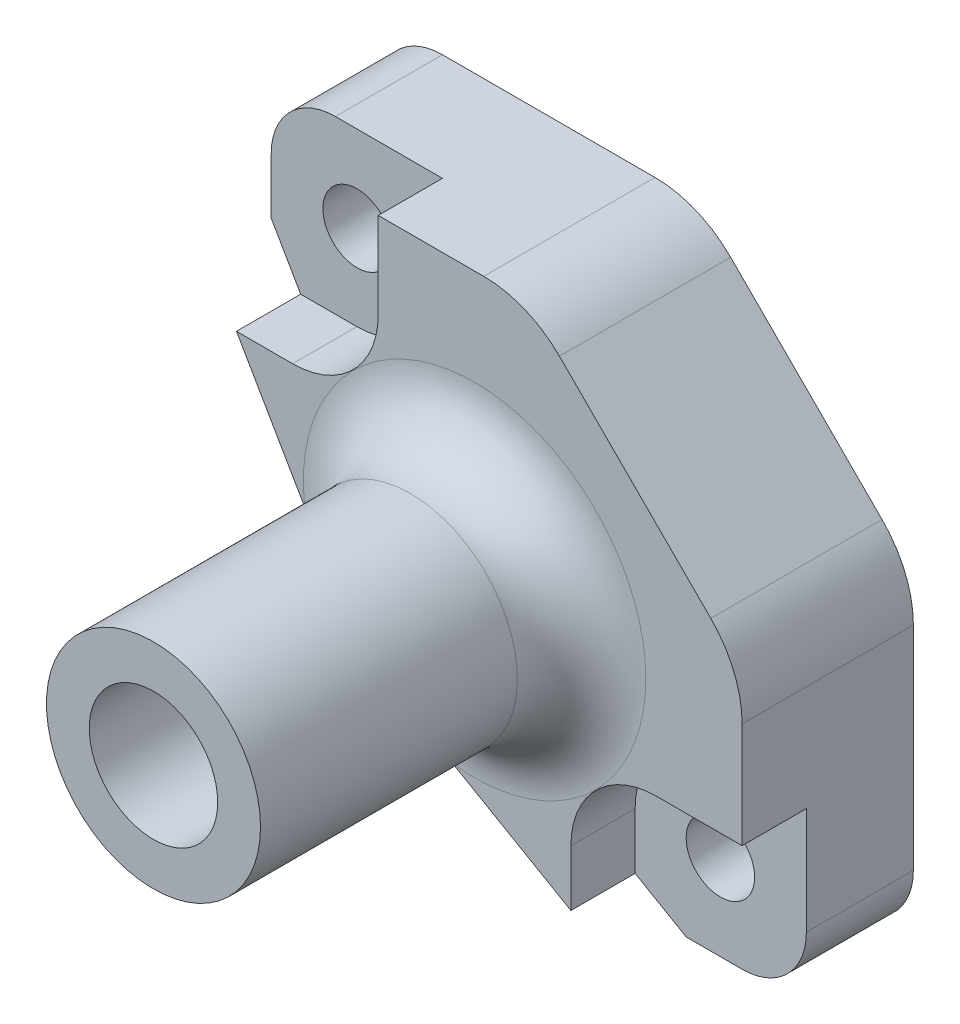
ISO-10303-21;
HEADER;
FILE_DESCRIPTION(('STEP AP214'),'2;1');
FILE_NAME('part.step','',(''),(''),'','','');
FILE_SCHEMA(('AUTOMOTIVE_DESIGN { 1 0 10303 214 1 1 1 1 }'));
ENDSEC;
DATA;
#1=APPLICATION_CONTEXT('core data for automotive mechanical design processes');
#2=APPLICATION_PROTOCOL_DEFINITION('international standard','automotive_design',2000,#1);
#3=PRODUCT_CONTEXT('',#1,'mechanical');
#4=PRODUCT('Part','Part','',(#3));
#5=PRODUCT_RELATED_PRODUCT_CATEGORY('part','',(#4));
#6=PRODUCT_DEFINITION_FORMATION('','',#4);
#7=PRODUCT_DEFINITION_CONTEXT('part definition',#1,'design');
#8=PRODUCT_DEFINITION('design','',#6,#7);
#9=PRODUCT_DEFINITION_SHAPE('','',#8);
#10=(LENGTH_UNIT() NAMED_UNIT(*) SI_UNIT(.MILLI.,.METRE.));
#11=(NAMED_UNIT(*) PLANE_ANGLE_UNIT() SI_UNIT($,.RADIAN.));
#12=(NAMED_UNIT(*) SI_UNIT($,.STERADIAN.) SOLID_ANGLE_UNIT());
#13=UNCERTAINTY_MEASURE_WITH_UNIT(LENGTH_MEASURE(1.E-05),#10,'distance_accuracy_value','');
#14=(GEOMETRIC_REPRESENTATION_CONTEXT(3) GLOBAL_UNCERTAINTY_ASSIGNED_CONTEXT((#13)) GLOBAL_UNIT_ASSIGNED_CONTEXT((#10,
#11,#12)) REPRESENTATION_CONTEXT('',''));
#15=CARTESIAN_POINT('',(0.,0.,0.));
#16=DIRECTION('',(0.,0.,1.));
#17=DIRECTION('',(1.,0.,0.));
#18=AXIS2_PLACEMENT_3D('',#15,#16,#17);
#19=CARTESIAN_POINT('',(0.,0.,11.));
#20=DIRECTION('',(0.,0.,1.));
#21=DIRECTION('',(1.,0.,0.));
#22=AXIS2_PLACEMENT_3D('',#19,#20,#21);
#23=TOROIDAL_SURFACE('',#22,8.,3.);
#24=CARTESIAN_POINT('',(0.,0.,11.));
#25=DIRECTION('',(0.,0.,1.));
#26=DIRECTION('',(1.,0.,0.));
#27=AXIS2_PLACEMENT_3D('',#24,#25,#26);
#28=CIRCLE('',#27,5.);
#29=CARTESIAN_POINT('',(5.,0.,11.));
#30=VERTEX_POINT('',#29);
#31=EDGE_CURVE('E264',#30,#30,#28,.T.);
#32=ORIENTED_EDGE('',*,*,#31,.F.);
#33=EDGE_LOOP('',(#32));
#34=FACE_BOUND('',#33,.T.);
#35=CARTESIAN_POINT('',(-7.93448688415343,-1.02241930220543,8.00000000131894));
#36=CARTESIAN_POINT('',(-7.8088171665432,-1.24009801160835,8.00000243111121));
#37=CARTESIAN_POINT('',(-7.67884244742595,-1.4551843651709,8.00468015560461));
#38=CARTESIAN_POINT('',(-7.4105698135832,-1.87976914803965,8.02025542132506));
#39=CARTESIAN_POINT('',(-7.27227517058231,-2.08926972772333,8.0311505317469));
#40=CARTESIAN_POINT('',(-6.98733676125992,-2.50276113810623,8.05605340391338));
#41=CARTESIAN_POINT('',(-6.84068074754209,-2.70674320581937,8.07006582365957));
#42=CARTESIAN_POINT('',(-6.53933645503834,-3.10871378450686,8.09815838258321));
#43=CARTESIAN_POINT('',(-6.38464744067679,-3.30670174396834,8.11223852785474));
#44=CARTESIAN_POINT('',(-6.0708692126933,-3.6921936004414,8.13742627965764));
#45=CARTESIAN_POINT('',(-5.91195027708333,-3.87983209640176,8.14859217344099));
#46=CARTESIAN_POINT('',(-5.58679354219154,-4.24887794482015,8.16629557736535));
#47=CARTESIAN_POINT('',(-5.42055619637551,-4.43028568211408,8.17283337384654));
#48=CARTESIAN_POINT('',(-5.08123038973987,-4.78634397434978,8.18007152981985));
#49=CARTESIAN_POINT('',(-4.90814920852779,-4.96100133807051,8.18077793265622));
#50=CARTESIAN_POINT('',(-4.55534116188415,-5.30338344577545,8.17623394480544));
#51=CARTESIAN_POINT('',(-4.37561443919472,-5.47110833850116,8.17098368199196));
#52=CARTESIAN_POINT('',(-4.07196346978309,-5.74359486272771,8.15813849286534));
#53=CARTESIAN_POINT('',(-3.94980579510217,-5.85040345626428,8.15194438425557));
#54=CARTESIAN_POINT('',(-3.70283234289101,-6.06079316929327,8.13790663407577));
#55=CARTESIAN_POINT('',(-3.57801650184856,-6.16437421152306,8.13006295305229));
#56=CARTESIAN_POINT('',(-3.1996333732305,-6.47024148093036,8.10497736563694));
#57=CARTESIAN_POINT('',(-2.94217635731903,-6.66761068985613,8.08618330198338));
#58=CARTESIAN_POINT('',(-2.41337987911285,-7.05177412584003,8.05027603628582));
#59=CARTESIAN_POINT('',(-2.14188973425362,-7.23836431587453,8.03319241244911));
#60=CARTESIAN_POINT('',(-1.58925236384683,-7.59725396396319,8.00806159787877));
#61=CARTESIAN_POINT('',(-1.30810503282311,-7.76955326586146,8.00001450587488));
#62=CARTESIAN_POINT('',(-1.02241930220544,-7.93448688415343,8.00000000131894));
#63=B_SPLINE_CURVE_WITH_KNOTS('',3,(#35,#36,#37,#38,#39,#40,#41,#42,#43,#44,#45,#46,#47,#48,#49,
#50,#51,#52,#53,#54,#55,#56,#57,#58,#59,#60,#61,#62),.UNSPECIFIED.,.F.,.F.,(4,2,2,2,2,2,2,2,2,2,
2,2,2,4),(0.,0.753828618587675,1.50736271527105,2.2620304254513,3.0167673622417,
3.75499425669759,4.49317547309418,5.23059158182436,5.9679918605027,6.45508744147399,
6.94219467382236,7.9165939358373,8.90566846173468,9.89475379378134),.UNSPECIFIED.);
#64=CARTESIAN_POINT('',(-7.93437141573023,-1.02261930220543,8.));
#65=VERTEX_POINT('',#64);
#66=CARTESIAN_POINT('',(-1.02261930220543,-7.93437141573022,8.));
#67=VERTEX_POINT('',#66);
#68=EDGE_CURVE('E358',#65,#67,#63,.T.);
#69=ORIENTED_EDGE('',*,*,#68,.T.);
#70=CARTESIAN_POINT('',(0.,0.,8.));
#71=DIRECTION('',(0.,0.,1.));
#72=DIRECTION('',(1.,0.,0.));
#73=AXIS2_PLACEMENT_3D('',#70,#71,#72);
#74=CIRCLE('',#73,8.);
#75=EDGE_CURVE('E274',#65,#67,#74,.F.);
#76=ORIENTED_EDGE('',*,*,#75,.F.);
#77=EDGE_LOOP('',(#69,#76));
#78=FACE_BOUND('',#77,.T.);
#79=ADVANCED_FACE('F32',(#34,#78),#23,.F.);
#80=CARTESIAN_POINT('',(0.,0.,8.));
#81=DIRECTION('',(0.,0.,1.));
#82=DIRECTION('',(1.,0.,0.));
#83=AXIS2_PLACEMENT_3D('',#80,#81,#82);
#84=PLANE('',#83);
#85=DIRECTION('',(-0.500000000000001,0.866025403784438,0.));
#86=VECTOR('',#85,1.);
#87=CARTESIAN_POINT('',(-7.93437141573023,-1.02261930220543,8.));
#88=LINE('',#87,#86);
#89=CARTESIAN_POINT('',(-11.1228571564904,4.5,8.));
#90=VERTEX_POINT('',#89);
#91=EDGE_CURVE('E47',#65,#90,#88,.T.);
#92=ORIENTED_EDGE('',*,*,#91,.F.);
#93=ORIENTED_EDGE('',*,*,#75,.T.);
#94=DIRECTION('',(-0.866025403784438,0.500000000000001,0.));
#95=VECTOR('',#94,1.);
#96=CARTESIAN_POINT('',(-1.02261930220543,-7.93437141573023,8.));
#97=LINE('',#96,#95);
#98=CARTESIAN_POINT('',(4.5,-11.1228571564904,8.));
#99=VERTEX_POINT('',#98);
#100=EDGE_CURVE('E347',#99,#67,#97,.T.);
#101=ORIENTED_EDGE('',*,*,#100,.F.);
#102=DIRECTION('',(0.,1.,0.));
#103=VECTOR('',#102,1.);
#104=CARTESIAN_POINT('',(4.5,0.,8.));
#105=LINE('',#104,#103);
#106=CARTESIAN_POINT('',(4.5,-8.5,8.));
#107=VERTEX_POINT('',#106);
#108=EDGE_CURVE('E277',#99,#107,#105,.T.);
#109=ORIENTED_EDGE('',*,*,#108,.T.);
#110=CARTESIAN_POINT('',(8.5,-8.5,8.));
#111=DIRECTION('',(0.,0.,1.));
#112=DIRECTION('',(1.,0.,0.));
#113=AXIS2_PLACEMENT_3D('',#110,#111,#112);
#114=CIRCLE('',#113,4.);
#115=CARTESIAN_POINT('',(8.5,-4.5,8.));
#116=VERTEX_POINT('',#115);
#117=EDGE_CURVE('E285',#107,#116,#114,.F.);
#118=ORIENTED_EDGE('',*,*,#117,.T.);
#119=DIRECTION('',(1.,0.,0.));
#120=VECTOR('',#119,1.);
#121=CARTESIAN_POINT('',(0.,-4.5,8.));
#122=LINE('',#121,#120);
#123=CARTESIAN_POINT('',(12.5,-4.5,8.));
#124=VERTEX_POINT('',#123);
#125=EDGE_CURVE('E288',#116,#124,#122,.T.);
#126=ORIENTED_EDGE('',*,*,#125,.T.);
#127=DIRECTION('',(0.,1.,0.));
#128=VECTOR('',#127,1.);
#129=CARTESIAN_POINT('',(12.5,12.5,8.));
#130=LINE('',#129,#128);
#131=CARTESIAN_POINT('',(12.5,0.428932188134527,8.));
#132=VERTEX_POINT('',#131);
#133=EDGE_CURVE('E258',#124,#132,#130,.T.);
#134=ORIENTED_EDGE('',*,*,#133,.T.);
#135=CARTESIAN_POINT('',(7.5,0.428932188134527,8.));
#136=DIRECTION('',(0.,0.,1.));
#137=DIRECTION('',(1.,0.,0.));
#138=AXIS2_PLACEMENT_3D('',#135,#136,#137);
#139=CIRCLE('',#138,5.);
#140=CARTESIAN_POINT('',(11.0355339059327,3.96446609406726,8.));
#141=VERTEX_POINT('',#140);
#142=EDGE_CURVE('E301',#132,#141,#139,.T.);
#143=ORIENTED_EDGE('',*,*,#142,.T.);
#144=DIRECTION('',(0.707106781186548,-0.707106781186547,0.));
#145=VECTOR('',#144,1.);
#146=CARTESIAN_POINT('',(2.5,12.5,8.));
#147=LINE('',#146,#145);
#148=CARTESIAN_POINT('',(3.96446609406726,11.0355339059327,8.));
#149=VERTEX_POINT('',#148);
#150=EDGE_CURVE('E372',#149,#141,#147,.T.);
#151=ORIENTED_EDGE('',*,*,#150,.F.);
#152=CARTESIAN_POINT('',(0.428932188134525,7.5,8.));
#153=DIRECTION('',(0.,0.,1.));
#154=DIRECTION('',(1.,0.,0.));
#155=AXIS2_PLACEMENT_3D('',#152,#153,#154);
#156=CIRCLE('',#155,5.);
#157=CARTESIAN_POINT('',(0.428932188134525,12.5,8.));
#158=VERTEX_POINT('',#157);
#159=EDGE_CURVE('E299',#149,#158,#156,.T.);
#160=ORIENTED_EDGE('',*,*,#159,.T.);
#161=DIRECTION('',(-1.,0.,0.));
#162=VECTOR('',#161,1.);
#163=CARTESIAN_POINT('',(-12.5,12.5,8.));
#164=LINE('',#163,#162);
#165=CARTESIAN_POINT('',(-4.5,12.5,8.));
#166=VERTEX_POINT('',#165);
#167=EDGE_CURVE('E261',#158,#166,#164,.T.);
#168=ORIENTED_EDGE('',*,*,#167,.T.);
#169=DIRECTION('',(0.,-1.,0.));
#170=VECTOR('',#169,1.);
#171=CARTESIAN_POINT('',(-4.5,0.,8.));
#172=LINE('',#171,#170);
#173=CARTESIAN_POINT('',(-4.5,8.5,8.));
#174=VERTEX_POINT('',#173);
#175=EDGE_CURVE('E210',#166,#174,#172,.T.);
#176=ORIENTED_EDGE('',*,*,#175,.T.);
#177=CARTESIAN_POINT('',(-8.5,8.5,8.));
#178=DIRECTION('',(0.,0.,1.));
#179=DIRECTION('',(1.,0.,0.));
#180=AXIS2_PLACEMENT_3D('',#177,#178,#179);
#181=CIRCLE('',#180,4.);
#182=CARTESIAN_POINT('',(-8.5,4.5,8.));
#183=VERTEX_POINT('',#182);
#184=EDGE_CURVE('E291',#174,#183,#181,.F.);
#185=ORIENTED_EDGE('',*,*,#184,.T.);
#186=DIRECTION('',(-1.,0.,0.));
#187=VECTOR('',#186,1.);
#188=CARTESIAN_POINT('',(0.,4.5,8.));
#189=LINE('',#188,#187);
#190=EDGE_CURVE('E208',#183,#90,#189,.T.);
#191=ORIENTED_EDGE('',*,*,#190,.T.);
#192=EDGE_LOOP('',(#92,#93,#101,#109,#118,#126,#134,#143,#151,#160,#168,#176,#185,#191));
#193=FACE_BOUND('',#192,.T.);
#194=ADVANCED_FACE('F389',(#193),#84,.T.);
#195=CARTESIAN_POINT('',(-12.5,12.5,8.));
#196=DIRECTION('',(0.,-1.,0.));
#197=DIRECTION('',(0.,0.,-1.));
#198=AXIS2_PLACEMENT_3D('',#195,#196,#197);
#199=PLANE('',#198);
#200=DIRECTION('',(-1.,0.,0.));
#201=VECTOR('',#200,1.);
#202=CARTESIAN_POINT('',(-12.5,12.5,0.));
#203=LINE('',#202,#201);
#204=CARTESIAN_POINT('',(0.428932188134525,12.5,0.));
#205=VERTEX_POINT('',#204);
#206=CARTESIAN_POINT('',(-9.5,12.5,0.));
#207=VERTEX_POINT('',#206);
#208=EDGE_CURVE('E266',#205,#207,#203,.T.);
#209=ORIENTED_EDGE('',*,*,#208,.T.);
#210=DIRECTION('',(0.,0.,-1.));
#211=VECTOR('',#210,1.);
#212=CARTESIAN_POINT('',(-9.5,12.5,8.));
#213=LINE('',#212,#211);
#214=CARTESIAN_POINT('',(-9.5,12.5,5.));
#215=VERTEX_POINT('',#214);
#216=EDGE_CURVE('E40',#207,#215,#213,.F.);
#217=ORIENTED_EDGE('',*,*,#216,.T.);
#218=DIRECTION('',(-1.,0.,0.));
#219=VECTOR('',#218,1.);
#220=CARTESIAN_POINT('',(-4.5,12.5,5.));
#221=LINE('',#220,#219);
#222=CARTESIAN_POINT('',(-4.5,12.5,5.));
#223=VERTEX_POINT('',#222);
#224=EDGE_CURVE('E196',#223,#215,#221,.T.);
#225=ORIENTED_EDGE('',*,*,#224,.F.);
#226=DIRECTION('',(0.,0.,-1.));
#227=VECTOR('',#226,1.);
#228=CARTESIAN_POINT('',(-4.5,12.5,23.));
#229=LINE('',#228,#227);
#230=EDGE_CURVE('E202',#166,#223,#229,.T.);
#231=ORIENTED_EDGE('',*,*,#230,.F.);
#232=ORIENTED_EDGE('',*,*,#167,.F.);
#233=DIRECTION('',(0.,0.,1.));
#234=VECTOR('',#233,1.);
#235=CARTESIAN_POINT('',(0.428932188134525,12.5,8.));
#236=LINE('',#235,#234);
#237=EDGE_CURVE('E313',#158,#205,#236,.F.);
#238=ORIENTED_EDGE('',*,*,#237,.T.);
#239=EDGE_LOOP('',(#209,#217,#225,#231,#232,#238));
#240=FACE_BOUND('',#239,.T.);
#241=ADVANCED_FACE('F395',(#240),#199,.F.);
#242=CARTESIAN_POINT('',(-12.5,12.5,8.));
#243=DIRECTION('',(1.,0.,0.));
#244=DIRECTION('',(0.,1.,0.));
#245=AXIS2_PLACEMENT_3D('',#242,#243,#244);
#246=PLANE('',#245);
#247=DIRECTION('',(0.,-1.,0.));
#248=VECTOR('',#247,1.);
#249=CARTESIAN_POINT('',(-12.5,12.5,0.));
#250=LINE('',#249,#248);
#251=CARTESIAN_POINT('',(-12.5,9.5,0.));
#252=VERTEX_POINT('',#251);
#253=CARTESIAN_POINT('',(-12.5,6.88528137423856,0.));
#254=VERTEX_POINT('',#253);
#255=EDGE_CURVE('E268',#252,#254,#250,.T.);
#256=ORIENTED_EDGE('',*,*,#255,.T.);
#257=DIRECTION('',(0.,0.,1.));
#258=VECTOR('',#257,1.);
#259=CARTESIAN_POINT('',(-12.5,6.88528137423856,-0.000999999999999265));
#260=LINE('',#259,#258);
#261=CARTESIAN_POINT('',(-12.5,6.88528137423856,5.));
#262=VERTEX_POINT('',#261);
#263=EDGE_CURVE('E356',#254,#262,#260,.T.);
#264=ORIENTED_EDGE('',*,*,#263,.T.);
#265=DIRECTION('',(0.,-1.,0.));
#266=VECTOR('',#265,1.);
#267=CARTESIAN_POINT('',(-12.5,12.5,5.));
#268=LINE('',#267,#266);
#269=CARTESIAN_POINT('',(-12.5,9.5,5.));
#270=VERTEX_POINT('',#269);
#271=EDGE_CURVE('E185',#270,#262,#268,.T.);
#272=ORIENTED_EDGE('',*,*,#271,.F.);
#273=DIRECTION('',(0.,0.,-1.));
#274=VECTOR('',#273,1.);
#275=CARTESIAN_POINT('',(-12.5,9.5,8.));
#276=LINE('',#275,#274);
#277=EDGE_CURVE('E328',#270,#252,#276,.T.);
#278=ORIENTED_EDGE('',*,*,#277,.T.);
#279=EDGE_LOOP('',(#256,#264,#272,#278));
#280=FACE_BOUND('',#279,.T.);
#281=ADVANCED_FACE('F333',(#280),#246,.F.);
#282=CARTESIAN_POINT('',(12.5,12.5,8.));
#283=DIRECTION('',(-1.,0.,0.));
#284=DIRECTION('',(0.,-1.,0.));
#285=AXIS2_PLACEMENT_3D('',#282,#283,#284);
#286=PLANE('',#285);
#287=DIRECTION('',(0.,1.,0.));
#288=VECTOR('',#287,1.);
#289=CARTESIAN_POINT('',(12.5,-12.5,5.));
#290=LINE('',#289,#288);
#291=CARTESIAN_POINT('',(12.5,-9.5,5.));
#292=VERTEX_POINT('',#291);
#293=CARTESIAN_POINT('',(12.5,-4.5,5.));
#294=VERTEX_POINT('',#293);
#295=EDGE_CURVE('E215',#292,#294,#290,.T.);
#296=ORIENTED_EDGE('',*,*,#295,.F.);
#297=DIRECTION('',(0.,0.,-1.));
#298=VECTOR('',#297,1.);
#299=CARTESIAN_POINT('',(12.5,-9.5,8.));
#300=LINE('',#299,#298);
#301=CARTESIAN_POINT('',(12.5,-9.5,0.));
#302=VERTEX_POINT('',#301);
#303=EDGE_CURVE('E315',#292,#302,#300,.T.);
#304=ORIENTED_EDGE('',*,*,#303,.T.);
#305=DIRECTION('',(0.,1.,0.));
#306=VECTOR('',#305,1.);
#307=CARTESIAN_POINT('',(12.5,12.5,0.));
#308=LINE('',#307,#306);
#309=CARTESIAN_POINT('',(12.5,0.428932188134527,0.));
#310=VERTEX_POINT('',#309);
#311=EDGE_CURVE('E257',#302,#310,#308,.T.);
#312=ORIENTED_EDGE('',*,*,#311,.T.);
#313=DIRECTION('',(0.,0.,1.));
#314=VECTOR('',#313,1.);
#315=CARTESIAN_POINT('',(12.5,0.428932188134527,8.));
#316=LINE('',#315,#314);
#317=EDGE_CURVE('E296',#310,#132,#316,.T.);
#318=ORIENTED_EDGE('',*,*,#317,.T.);
#319=ORIENTED_EDGE('',*,*,#133,.F.);
#320=DIRECTION('',(0.,0.,-1.));
#321=VECTOR('',#320,1.);
#322=CARTESIAN_POINT('',(12.5,-4.5,23.));
#323=LINE('',#322,#321);
#324=EDGE_CURVE('E230',#124,#294,#323,.T.);
#325=ORIENTED_EDGE('',*,*,#324,.T.);
#326=EDGE_LOOP('',(#296,#304,#312,#318,#319,#325));
#327=FACE_BOUND('',#326,.T.);
#328=ADVANCED_FACE('F402',(#327),#286,.F.);
#329=CARTESIAN_POINT('',(-12.5,-12.5,8.));
#330=DIRECTION('',(0.,1.,0.));
#331=DIRECTION('',(0.,0.,1.));
#332=AXIS2_PLACEMENT_3D('',#329,#330,#331);
#333=PLANE('',#332);
#334=DIRECTION('',(1.,0.,0.));
#335=VECTOR('',#334,1.);
#336=CARTESIAN_POINT('',(4.5,-12.5,5.));
#337=LINE('',#336,#335);
#338=CARTESIAN_POINT('',(6.88528137423857,-12.5,5.));
#339=VERTEX_POINT('',#338);
#340=CARTESIAN_POINT('',(9.5,-12.5,5.));
#341=VERTEX_POINT('',#340);
#342=EDGE_CURVE('E213',#339,#341,#337,.T.);
#343=ORIENTED_EDGE('',*,*,#342,.F.);
#344=DIRECTION('',(0.,0.,1.));
#345=VECTOR('',#344,1.);
#346=CARTESIAN_POINT('',(6.88528137423857,-12.5,-0.000999999999999265));
#347=LINE('',#346,#345);
#348=CARTESIAN_POINT('',(6.88528137423857,-12.5,0.));
#349=VERTEX_POINT('',#348);
#350=EDGE_CURVE('E355',#349,#339,#347,.T.);
#351=ORIENTED_EDGE('',*,*,#350,.F.);
#352=DIRECTION('',(1.,0.,0.));
#353=VECTOR('',#352,1.);
#354=CARTESIAN_POINT('',(-12.5,-12.5,0.));
#355=LINE('',#354,#353);
#356=CARTESIAN_POINT('',(9.5,-12.5,0.));
#357=VERTEX_POINT('',#356);
#358=EDGE_CURVE('E262',#349,#357,#355,.T.);
#359=ORIENTED_EDGE('',*,*,#358,.T.);
#360=DIRECTION('',(0.,0.,-1.));
#361=VECTOR('',#360,1.);
#362=CARTESIAN_POINT('',(9.5,-12.5,8.));
#363=LINE('',#362,#361);
#364=EDGE_CURVE('E323',#357,#341,#363,.F.);
#365=ORIENTED_EDGE('',*,*,#364,.T.);
#366=EDGE_LOOP('',(#343,#351,#359,#365));
#367=FACE_BOUND('',#366,.T.);
#368=ADVANCED_FACE('F449',(#367),#333,.F.);
#369=CARTESIAN_POINT('',(0.,0.,23.001));
#370=DIRECTION('',(0.,0.,-1.));
#371=DIRECTION('',(-1.,0.,0.));
#372=AXIS2_PLACEMENT_3D('',#369,#370,#371);
#373=CYLINDRICAL_SURFACE('',#372,1.6);
#374=CARTESIAN_POINT('',(0.,0.,4.));
#375=DIRECTION('',(0.,0.,-1.));
#376=DIRECTION('',(-1.,0.,0.));
#377=AXIS2_PLACEMENT_3D('',#374,#375,#376);
#378=CIRCLE('',#377,1.6);
#379=CARTESIAN_POINT('',(-1.6,0.,4.));
#380=VERTEX_POINT('',#379);
#381=EDGE_CURVE('E250',#380,#380,#378,.F.);
#382=ORIENTED_EDGE('',*,*,#381,.F.);
#383=EDGE_LOOP('',(#382));
#384=FACE_BOUND('',#383,.T.);
#385=CARTESIAN_POINT('',(0.,0.,7.));
#386=DIRECTION('',(0.,0.,1.));
#387=DIRECTION('',(1.,0.,0.));
#388=AXIS2_PLACEMENT_3D('',#385,#386,#387);
#389=CIRCLE('',#388,1.6);
#390=CARTESIAN_POINT('',(1.6,0.,7.));
#391=VERTEX_POINT('',#390);
#392=EDGE_CURVE('E244',#391,#391,#389,.F.);
#393=ORIENTED_EDGE('',*,*,#392,.F.);
#394=EDGE_LOOP('',(#393));
#395=FACE_BOUND('',#394,.T.);
#396=ADVANCED_FACE('F514',(#384,#395),#373,.F.);
#397=CARTESIAN_POINT('',(0.,0.,0.));
#398=DIRECTION('',(0.,0.,1.));
#399=DIRECTION('',(1.,0.,0.));
#400=AXIS2_PLACEMENT_3D('',#397,#398,#399);
#401=PLANE('',#400);
#402=CARTESIAN_POINT('',(8.48528137423857,-8.48528137423857,0.));
#403=DIRECTION('',(0.,0.,-1.));
#404=DIRECTION('',(-1.,0.,0.));
#405=AXIS2_PLACEMENT_3D('',#402,#403,#404);
#406=CIRCLE('',#405,1.6);
#407=CARTESIAN_POINT('',(6.88528137423857,-8.48528137423857,0.));
#408=VERTEX_POINT('',#407);
#409=EDGE_CURVE('E234',#408,#408,#406,.T.);
#410=ORIENTED_EDGE('',*,*,#409,.F.);
#411=EDGE_LOOP('',(#410));
#412=FACE_BOUND('',#411,.T.);
#413=CARTESIAN_POINT('',(-8.48528137423857,8.48528137423857,0.));
#414=DIRECTION('',(0.,0.,-1.));
#415=DIRECTION('',(-1.,0.,0.));
#416=AXIS2_PLACEMENT_3D('',#413,#414,#415);
#417=CIRCLE('',#416,1.6);
#418=CARTESIAN_POINT('',(-10.0852813742386,8.48528137423857,0.));
#419=VERTEX_POINT('',#418);
#420=EDGE_CURVE('E238',#419,#419,#417,.T.);
#421=ORIENTED_EDGE('',*,*,#420,.F.);
#422=EDGE_LOOP('',(#421));
#423=FACE_BOUND('',#422,.T.);
#424=CARTESIAN_POINT('',(0.,0.,0.));
#425=DIRECTION('',(0.,0.,-1.));
#426=DIRECTION('',(-1.,0.,0.));
#427=AXIS2_PLACEMENT_3D('',#424,#425,#426);
#428=CIRCLE('',#427,3.);
#429=CARTESIAN_POINT('',(-3.,0.,0.));
#430=VERTEX_POINT('',#429);
#431=EDGE_CURVE('E251',#430,#430,#428,.T.);
#432=ORIENTED_EDGE('',*,*,#431,.F.);
#433=EDGE_LOOP('',(#432));
#434=FACE_BOUND('',#433,.T.);
#435=CARTESIAN_POINT('',(8.41900966953028,8.41900966953028,0.));
#436=DIRECTION('',(0.,0.,1.));
#437=DIRECTION('',(1.,0.,0.));
#438=AXIS2_PLACEMENT_3D('',#435,#436,#437);
#439=CIRCLE('',#438,18.8832579434714);
#440=CARTESIAN_POINT('',(-7.93437141573023,-1.02261930220543,0.));
#441=VERTEX_POINT('',#440);
#442=CARTESIAN_POINT('',(-1.02261930220543,-7.93437141573022,0.));
#443=VERTEX_POINT('',#442);
#444=EDGE_CURVE('E344',#441,#443,#439,.T.);
#445=ORIENTED_EDGE('',*,*,#444,.F.);
#446=DIRECTION('',(0.500000000000001,-0.866025403784438,0.));
#447=VECTOR('',#446,1.);
#448=CARTESIAN_POINT('',(-7.93437141573023,-1.02261930220543,0.));
#449=LINE('',#448,#447);
#450=EDGE_CURVE('E341',#254,#441,#449,.T.);
#451=ORIENTED_EDGE('',*,*,#450,.F.);
#452=ORIENTED_EDGE('',*,*,#255,.F.);
#453=CARTESIAN_POINT('',(-9.5,9.5,0.));
#454=DIRECTION('',(0.,0.,1.));
#455=DIRECTION('',(1.,0.,0.));
#456=AXIS2_PLACEMENT_3D('',#453,#454,#455);
#457=CIRCLE('',#456,3.);
#458=EDGE_CURVE('E318',#252,#207,#457,.F.);
#459=ORIENTED_EDGE('',*,*,#458,.T.);
#460=ORIENTED_EDGE('',*,*,#208,.F.);
#461=CARTESIAN_POINT('',(0.428932188134525,7.5,0.));
#462=DIRECTION('',(0.,0.,1.));
#463=DIRECTION('',(1.,0.,0.));
#464=AXIS2_PLACEMENT_3D('',#461,#462,#463);
#465=CIRCLE('',#464,5.);
#466=CARTESIAN_POINT('',(3.96446609406726,11.0355339059327,0.));
#467=VERTEX_POINT('',#466);
#468=EDGE_CURVE('E308',#205,#467,#465,.F.);
#469=ORIENTED_EDGE('',*,*,#468,.T.);
#470=DIRECTION('',(-0.707106781186548,0.707106781186547,0.));
#471=VECTOR('',#470,1.);
#472=CARTESIAN_POINT('',(2.5,12.5,0.));
#473=LINE('',#472,#471);
#474=CARTESIAN_POINT('',(11.0355339059327,3.96446609406726,0.));
#475=VERTEX_POINT('',#474);
#476=EDGE_CURVE('E459',#475,#467,#473,.T.);
#477=ORIENTED_EDGE('',*,*,#476,.F.);
#478=CARTESIAN_POINT('',(7.5,0.428932188134527,0.));
#479=DIRECTION('',(0.,0.,1.));
#480=DIRECTION('',(1.,0.,0.));
#481=AXIS2_PLACEMENT_3D('',#478,#479,#480);
#482=CIRCLE('',#481,5.);
#483=EDGE_CURVE('E310',#475,#310,#482,.F.);
#484=ORIENTED_EDGE('',*,*,#483,.T.);
#485=ORIENTED_EDGE('',*,*,#311,.F.);
#486=CARTESIAN_POINT('',(9.5,-9.5,0.));
#487=DIRECTION('',(0.,0.,1.));
#488=DIRECTION('',(1.,0.,0.));
#489=AXIS2_PLACEMENT_3D('',#486,#487,#488);
#490=CIRCLE('',#489,3.);
#491=EDGE_CURVE('E320',#302,#357,#490,.F.);
#492=ORIENTED_EDGE('',*,*,#491,.T.);
#493=ORIENTED_EDGE('',*,*,#358,.F.);
#494=DIRECTION('',(0.866025403784438,-0.500000000000001,0.));
#495=VECTOR('',#494,1.);
#496=CARTESIAN_POINT('',(-1.02261930220543,-7.93437141573023,0.));
#497=LINE('',#496,#495);
#498=EDGE_CURVE('E186',#443,#349,#497,.T.);
#499=ORIENTED_EDGE('',*,*,#498,.F.);
#500=EDGE_LOOP('',(#445,#451,#452,#459,#460,#469,#477,#484,#485,#492,#493,#499));
#501=FACE_BOUND('',#500,.T.);
#502=ADVANCED_FACE('F339',(#412,#423,#434,#501),#401,.F.);
#503=CARTESIAN_POINT('',(0.,0.,23.));
#504=DIRECTION('',(0.,0.,-1.));
#505=DIRECTION('',(-1.,0.,0.));
#506=AXIS2_PLACEMENT_3D('',#503,#504,#505);
#507=CYLINDRICAL_SURFACE('',#506,5.);
#508=ORIENTED_EDGE('',*,*,#31,.T.);
#509=EDGE_LOOP('',(#508));
#510=FACE_BOUND('',#509,.T.);
#511=CARTESIAN_POINT('',(0.,0.,23.));
#512=DIRECTION('',(0.,0.,1.));
#513=DIRECTION('',(1.,0.,0.));
#514=AXIS2_PLACEMENT_3D('',#511,#512,#513);
#515=CIRCLE('',#514,5.);
#516=CARTESIAN_POINT('',(5.,0.,23.));
#517=VERTEX_POINT('',#516);
#518=EDGE_CURVE('E254',#517,#517,#515,.T.);
#519=ORIENTED_EDGE('',*,*,#518,.F.);
#520=EDGE_LOOP('',(#519));
#521=FACE_BOUND('',#520,.T.);
#522=ADVANCED_FACE('F520',(#510,#521),#507,.T.);
#523=CARTESIAN_POINT('',(0.,0.,23.));
#524=DIRECTION('',(0.,0.,1.));
#525=DIRECTION('',(1.,0.,0.));
#526=AXIS2_PLACEMENT_3D('',#523,#524,#525);
#527=PLANE('',#526);
#528=CARTESIAN_POINT('',(0.,0.,23.));
#529=DIRECTION('',(0.,0.,1.));
#530=DIRECTION('',(1.,0.,0.));
#531=AXIS2_PLACEMENT_3D('',#528,#529,#530);
#532=CIRCLE('',#531,3.);
#533=CARTESIAN_POINT('',(3.,0.,23.));
#534=VERTEX_POINT('',#533);
#535=EDGE_CURVE('E237',#534,#534,#532,.T.);
#536=ORIENTED_EDGE('',*,*,#535,.F.);
#537=EDGE_LOOP('',(#536));
#538=FACE_BOUND('',#537,.T.);
#539=ORIENTED_EDGE('',*,*,#518,.T.);
#540=EDGE_LOOP('',(#539));
#541=FACE_BOUND('',#540,.T.);
#542=ADVANCED_FACE('F509',(#538,#541),#527,.T.);
#543=CARTESIAN_POINT('',(0.,0.,4.));
#544=DIRECTION('',(0.,0.,-1.));
#545=DIRECTION('',(-1.,0.,0.));
#546=AXIS2_PLACEMENT_3D('',#543,#544,#545);
#547=PLANE('',#546);
#548=CARTESIAN_POINT('',(0.,0.,4.));
#549=DIRECTION('',(0.,0.,-1.));
#550=DIRECTION('',(-1.,0.,0.));
#551=AXIS2_PLACEMENT_3D('',#548,#549,#550);
#552=CIRCLE('',#551,3.);
#553=CARTESIAN_POINT('',(-3.,0.,4.));
#554=VERTEX_POINT('',#553);
#555=EDGE_CURVE('E247',#554,#554,#552,.T.);
#556=ORIENTED_EDGE('',*,*,#555,.T.);
#557=EDGE_LOOP('',(#556));
#558=FACE_BOUND('',#557,.T.);
#559=ORIENTED_EDGE('',*,*,#381,.T.);
#560=EDGE_LOOP('',(#559));
#561=FACE_BOUND('',#560,.T.);
#562=ADVANCED_FACE('F506',(#558,#561),#547,.T.);
#563=CARTESIAN_POINT('',(0.,0.,4.));
#564=DIRECTION('',(0.,0.,-1.));
#565=DIRECTION('',(-1.,0.,0.));
#566=AXIS2_PLACEMENT_3D('',#563,#564,#565);
#567=CYLINDRICAL_SURFACE('',#566,3.);
#568=ORIENTED_EDGE('',*,*,#555,.F.);
#569=EDGE_LOOP('',(#568));
#570=FACE_BOUND('',#569,.T.);
#571=ORIENTED_EDGE('',*,*,#431,.T.);
#572=EDGE_LOOP('',(#571));
#573=FACE_BOUND('',#572,.T.);
#574=ADVANCED_FACE('F501',(#570,#573),#567,.F.);
#575=CARTESIAN_POINT('',(0.,0.,7.));
#576=DIRECTION('',(0.,0.,1.));
#577=DIRECTION('',(1.,0.,0.));
#578=AXIS2_PLACEMENT_3D('',#575,#576,#577);
#579=PLANE('',#578);
#580=CARTESIAN_POINT('',(0.,0.,7.));
#581=DIRECTION('',(0.,0.,1.));
#582=DIRECTION('',(1.,0.,0.));
#583=AXIS2_PLACEMENT_3D('',#580,#581,#582);
#584=CIRCLE('',#583,3.);
#585=CARTESIAN_POINT('',(3.,0.,7.));
#586=VERTEX_POINT('',#585);
#587=EDGE_CURVE('E241',#586,#586,#584,.T.);
#588=ORIENTED_EDGE('',*,*,#587,.T.);
#589=EDGE_LOOP('',(#588));
#590=FACE_BOUND('',#589,.T.);
#591=ORIENTED_EDGE('',*,*,#392,.T.);
#592=EDGE_LOOP('',(#591));
#593=FACE_BOUND('',#592,.T.);
#594=ADVANCED_FACE('F498',(#590,#593),#579,.T.);
#595=CARTESIAN_POINT('',(0.,0.,7.));
#596=DIRECTION('',(0.,0.,1.));
#597=DIRECTION('',(1.,0.,0.));
#598=AXIS2_PLACEMENT_3D('',#595,#596,#597);
#599=CYLINDRICAL_SURFACE('',#598,3.);
#600=ORIENTED_EDGE('',*,*,#587,.F.);
#601=EDGE_LOOP('',(#600));
#602=FACE_BOUND('',#601,.T.);
#603=ORIENTED_EDGE('',*,*,#535,.T.);
#604=EDGE_LOOP('',(#603));
#605=FACE_BOUND('',#604,.T.);
#606=ADVANCED_FACE('F496',(#602,#605),#599,.F.);
#607=CARTESIAN_POINT('',(-8.48528137423857,8.48528137423857,23.001));
#608=DIRECTION('',(0.,0.,-1.));
#609=DIRECTION('',(-1.,0.,0.));
#610=AXIS2_PLACEMENT_3D('',#607,#608,#609);
#611=CYLINDRICAL_SURFACE('',#610,1.6);
#612=CARTESIAN_POINT('',(-8.48528137423857,8.48528137423857,5.));
#613=DIRECTION('',(0.,0.,-1.));
#614=DIRECTION('',(-1.,0.,0.));
#615=AXIS2_PLACEMENT_3D('',#612,#613,#614);
#616=CIRCLE('',#615,1.6);
#617=CARTESIAN_POINT('',(-10.0852813742386,8.48528137423857,5.));
#618=VERTEX_POINT('',#617);
#619=EDGE_CURVE('E207',#618,#618,#616,.F.);
#620=ORIENTED_EDGE('',*,*,#619,.T.);
#621=EDGE_LOOP('',(#620));
#622=FACE_BOUND('',#621,.T.);
#623=ORIENTED_EDGE('',*,*,#420,.T.);
#624=EDGE_LOOP('',(#623));
#625=FACE_BOUND('',#624,.T.);
#626=ADVANCED_FACE('F492',(#622,#625),#611,.F.);
#627=CARTESIAN_POINT('',(8.48528137423857,-8.48528137423857,23.001));
#628=DIRECTION('',(0.,0.,-1.));
#629=DIRECTION('',(-1.,0.,0.));
#630=AXIS2_PLACEMENT_3D('',#627,#628,#629);
#631=CYLINDRICAL_SURFACE('',#630,1.6);
#632=CARTESIAN_POINT('',(8.48528137423857,-8.48528137423857,5.));
#633=DIRECTION('',(0.,0.,-1.));
#634=DIRECTION('',(-1.,0.,0.));
#635=AXIS2_PLACEMENT_3D('',#632,#633,#634);
#636=CIRCLE('',#635,1.6);
#637=CARTESIAN_POINT('',(6.88528137423857,-8.48528137423857,5.));
#638=VERTEX_POINT('',#637);
#639=EDGE_CURVE('E233',#638,#638,#636,.F.);
#640=ORIENTED_EDGE('',*,*,#639,.T.);
#641=EDGE_LOOP('',(#640));
#642=FACE_BOUND('',#641,.T.);
#643=ORIENTED_EDGE('',*,*,#409,.T.);
#644=EDGE_LOOP('',(#643));
#645=FACE_BOUND('',#644,.T.);
#646=ADVANCED_FACE('F483',(#642,#645),#631,.F.);
#647=CARTESIAN_POINT('',(8.5,-8.5,5.));
#648=DIRECTION('',(0.,0.,-1.));
#649=DIRECTION('',(-1.,0.,0.));
#650=AXIS2_PLACEMENT_3D('',#647,#648,#649);
#651=PLANE('',#650);
#652=DIRECTION('',(0.,-1.,0.));
#653=VECTOR('',#652,1.);
#654=CARTESIAN_POINT('',(4.5,-12.5,5.));
#655=LINE('',#654,#653);
#656=CARTESIAN_POINT('',(4.5,-8.5,5.));
#657=VERTEX_POINT('',#656);
#658=CARTESIAN_POINT('',(4.5,-11.1228571564904,5.));
#659=VERTEX_POINT('',#658);
#660=EDGE_CURVE('E223',#657,#659,#655,.T.);
#661=ORIENTED_EDGE('',*,*,#660,.T.);
#662=DIRECTION('',(-0.866025403784438,0.500000000000001,0.));
#663=VECTOR('',#662,1.);
#664=CARTESIAN_POINT('',(-1.02261930220543,-7.93437141573023,5.));
#665=LINE('',#664,#663);
#666=EDGE_CURVE('E345',#339,#659,#665,.T.);
#667=ORIENTED_EDGE('',*,*,#666,.F.);
#668=ORIENTED_EDGE('',*,*,#342,.T.);
#669=CARTESIAN_POINT('',(9.5,-9.5,5.));
#670=DIRECTION('',(0.,0.,-1.));
#671=DIRECTION('',(-1.,0.,0.));
#672=AXIS2_PLACEMENT_3D('',#669,#670,#671);
#673=CIRCLE('',#672,3.);
#674=EDGE_CURVE('E326',#341,#292,#673,.F.);
#675=ORIENTED_EDGE('',*,*,#674,.T.);
#676=ORIENTED_EDGE('',*,*,#295,.T.);
#677=DIRECTION('',(-1.,0.,0.));
#678=VECTOR('',#677,1.);
#679=CARTESIAN_POINT('',(12.5,-4.5,5.));
#680=LINE('',#679,#678);
#681=CARTESIAN_POINT('',(8.5,-4.5,5.));
#682=VERTEX_POINT('',#681);
#683=EDGE_CURVE('E217',#294,#682,#680,.T.);
#684=ORIENTED_EDGE('',*,*,#683,.T.);
#685=CARTESIAN_POINT('',(8.5,-8.5,5.));
#686=DIRECTION('',(0.,0.,1.));
#687=DIRECTION('',(-1.,0.,0.));
#688=AXIS2_PLACEMENT_3D('',#685,#686,#687);
#689=CIRCLE('',#688,4.);
#690=EDGE_CURVE('E220',#682,#657,#689,.T.);
#691=ORIENTED_EDGE('',*,*,#690,.T.);
#692=EDGE_LOOP('',(#661,#667,#668,#675,#676,#684,#691));
#693=FACE_BOUND('',#692,.T.);
#694=ORIENTED_EDGE('',*,*,#639,.F.);
#695=EDGE_LOOP('',(#694));
#696=FACE_BOUND('',#695,.T.);
#697=ADVANCED_FACE('F423',(#693,#696),#651,.F.);
#698=CARTESIAN_POINT('',(12.5,-4.5,23.));
#699=DIRECTION('',(0.,-1.,0.));
#700=DIRECTION('',(1.,0.,0.));
#701=AXIS2_PLACEMENT_3D('',#698,#699,#700);
#702=PLANE('',#701);
#703=DIRECTION('',(0.,0.,-1.));
#704=VECTOR('',#703,1.);
#705=CARTESIAN_POINT('',(8.5,-4.5,23.));
#706=LINE('',#705,#704);
#707=EDGE_CURVE('E228',#116,#682,#706,.T.);
#708=ORIENTED_EDGE('',*,*,#707,.T.);
#709=ORIENTED_EDGE('',*,*,#683,.F.);
#710=ORIENTED_EDGE('',*,*,#324,.F.);
#711=ORIENTED_EDGE('',*,*,#125,.F.);
#712=EDGE_LOOP('',(#708,#709,#710,#711));
#713=FACE_BOUND('',#712,.T.);
#714=ADVANCED_FACE('F432',(#713),#702,.T.);
#715=CARTESIAN_POINT('',(8.5,-8.5,23.));
#716=DIRECTION('',(0.,0.,-1.));
#717=DIRECTION('',(-1.,0.,0.));
#718=AXIS2_PLACEMENT_3D('',#715,#716,#717);
#719=CYLINDRICAL_SURFACE('',#718,4.);
#720=DIRECTION('',(0.,0.,-1.));
#721=VECTOR('',#720,1.);
#722=CARTESIAN_POINT('',(4.5,-8.5,23.));
#723=LINE('',#722,#721);
#724=EDGE_CURVE('E226',#107,#657,#723,.T.);
#725=ORIENTED_EDGE('',*,*,#724,.T.);
#726=ORIENTED_EDGE('',*,*,#690,.F.);
#727=ORIENTED_EDGE('',*,*,#707,.F.);
#728=ORIENTED_EDGE('',*,*,#117,.F.);
#729=EDGE_LOOP('',(#725,#726,#727,#728));
#730=FACE_BOUND('',#729,.T.);
#731=ADVANCED_FACE('F439',(#730),#719,.F.);
#732=CARTESIAN_POINT('',(4.5,-12.5,23.));
#733=DIRECTION('',(1.,0.,0.));
#734=DIRECTION('',(0.,0.,-1.));
#735=AXIS2_PLACEMENT_3D('',#732,#733,#734);
#736=PLANE('',#735);
#737=DIRECTION('',(0.,0.,-1.));
#738=VECTOR('',#737,1.);
#739=CARTESIAN_POINT('',(4.5,-11.1228571564904,-0.000999999999999265));
#740=LINE('',#739,#738);
#741=EDGE_CURVE('E175',#99,#659,#740,.T.);
#742=ORIENTED_EDGE('',*,*,#741,.T.);
#743=ORIENTED_EDGE('',*,*,#660,.F.);
#744=ORIENTED_EDGE('',*,*,#724,.F.);
#745=ORIENTED_EDGE('',*,*,#108,.F.);
#746=EDGE_LOOP('',(#742,#743,#744,#745));
#747=FACE_BOUND('',#746,.T.);
#748=ADVANCED_FACE('F444',(#747),#736,.T.);
#749=CARTESIAN_POINT('',(-8.5,8.5,5.));
#750=DIRECTION('',(0.,0.,-1.));
#751=DIRECTION('',(1.,0.,0.));
#752=AXIS2_PLACEMENT_3D('',#749,#750,#751);
#753=PLANE('',#752);
#754=ORIENTED_EDGE('',*,*,#271,.T.);
#755=DIRECTION('',(-0.500000000000001,0.866025403784438,0.));
#756=VECTOR('',#755,1.);
#757=CARTESIAN_POINT('',(-7.93437141573023,-1.02261930220543,5.));
#758=LINE('',#757,#756);
#759=CARTESIAN_POINT('',(-11.1228571564904,4.5,5.));
#760=VERTEX_POINT('',#759);
#761=EDGE_CURVE('E170',#760,#262,#758,.T.);
#762=ORIENTED_EDGE('',*,*,#761,.F.);
#763=DIRECTION('',(1.,0.,0.));
#764=VECTOR('',#763,1.);
#765=CARTESIAN_POINT('',(-12.5,4.5,5.));
#766=LINE('',#765,#764);
#767=CARTESIAN_POINT('',(-8.5,4.5,5.));
#768=VERTEX_POINT('',#767);
#769=EDGE_CURVE('E182',#760,#768,#766,.T.);
#770=ORIENTED_EDGE('',*,*,#769,.T.);
#771=CARTESIAN_POINT('',(-8.5,8.5,5.));
#772=DIRECTION('',(0.,0.,1.));
#773=DIRECTION('',(1.,0.,0.));
#774=AXIS2_PLACEMENT_3D('',#771,#772,#773);
#775=CIRCLE('',#774,4.);
#776=CARTESIAN_POINT('',(-4.5,8.5,5.));
#777=VERTEX_POINT('',#776);
#778=EDGE_CURVE('E192',#768,#777,#775,.T.);
#779=ORIENTED_EDGE('',*,*,#778,.T.);
#780=DIRECTION('',(0.,1.,0.));
#781=VECTOR('',#780,1.);
#782=CARTESIAN_POINT('',(-4.5,12.5,5.));
#783=LINE('',#782,#781);
#784=EDGE_CURVE('E194',#777,#223,#783,.T.);
#785=ORIENTED_EDGE('',*,*,#784,.T.);
#786=ORIENTED_EDGE('',*,*,#224,.T.);
#787=CARTESIAN_POINT('',(-9.5,9.5,5.));
#788=DIRECTION('',(0.,0.,-1.));
#789=DIRECTION('',(-1.,0.,0.));
#790=AXIS2_PLACEMENT_3D('',#787,#788,#789);
#791=CIRCLE('',#790,3.);
#792=EDGE_CURVE('E11',#215,#270,#791,.F.);
#793=ORIENTED_EDGE('',*,*,#792,.T.);
#794=EDGE_LOOP('',(#754,#762,#770,#779,#785,#786,#793));
#795=FACE_BOUND('',#794,.T.);
#796=ORIENTED_EDGE('',*,*,#619,.F.);
#797=EDGE_LOOP('',(#796));
#798=FACE_BOUND('',#797,.T.);
#799=ADVANCED_FACE('F179',(#795,#798),#753,.F.);
#800=CARTESIAN_POINT('',(-12.5,4.5,23.));
#801=DIRECTION('',(0.,1.,0.));
#802=DIRECTION('',(-1.,0.,0.));
#803=AXIS2_PLACEMENT_3D('',#800,#801,#802);
#804=PLANE('',#803);
#805=DIRECTION('',(0.,0.,1.));
#806=VECTOR('',#805,1.);
#807=CARTESIAN_POINT('',(-11.1228571564904,4.5,-0.000999999999999265));
#808=LINE('',#807,#806);
#809=EDGE_CURVE('E166',#760,#90,#808,.T.);
#810=ORIENTED_EDGE('',*,*,#809,.T.);
#811=ORIENTED_EDGE('',*,*,#190,.F.);
#812=DIRECTION('',(0.,0.,-1.));
#813=VECTOR('',#812,1.);
#814=CARTESIAN_POINT('',(-8.5,4.5,23.));
#815=LINE('',#814,#813);
#816=EDGE_CURVE('E190',#183,#768,#815,.T.);
#817=ORIENTED_EDGE('',*,*,#816,.T.);
#818=ORIENTED_EDGE('',*,*,#769,.F.);
#819=EDGE_LOOP('',(#810,#811,#817,#818));
#820=FACE_BOUND('',#819,.T.);
#821=ADVANCED_FACE('F188',(#820),#804,.T.);
#822=CARTESIAN_POINT('',(-8.5,8.5,23.));
#823=DIRECTION('',(0.,0.,-1.));
#824=DIRECTION('',(-1.,0.,0.));
#825=AXIS2_PLACEMENT_3D('',#822,#823,#824);
#826=CYLINDRICAL_SURFACE('',#825,4.);
#827=DIRECTION('',(0.,0.,-1.));
#828=VECTOR('',#827,1.);
#829=CARTESIAN_POINT('',(-4.5,8.5,23.));
#830=LINE('',#829,#828);
#831=EDGE_CURVE('E204',#174,#777,#830,.T.);
#832=ORIENTED_EDGE('',*,*,#831,.T.);
#833=ORIENTED_EDGE('',*,*,#778,.F.);
#834=ORIENTED_EDGE('',*,*,#816,.F.);
#835=ORIENTED_EDGE('',*,*,#184,.F.);
#836=EDGE_LOOP('',(#832,#833,#834,#835));
#837=FACE_BOUND('',#836,.T.);
#838=ADVANCED_FACE('F470',(#837),#826,.F.);
#839=CARTESIAN_POINT('',(-4.5,12.5,23.));
#840=DIRECTION('',(-1.,0.,0.));
#841=DIRECTION('',(0.,0.,1.));
#842=AXIS2_PLACEMENT_3D('',#839,#840,#841);
#843=PLANE('',#842);
#844=ORIENTED_EDGE('',*,*,#230,.T.);
#845=ORIENTED_EDGE('',*,*,#784,.F.);
#846=ORIENTED_EDGE('',*,*,#831,.F.);
#847=ORIENTED_EDGE('',*,*,#175,.F.);
#848=EDGE_LOOP('',(#844,#845,#846,#847));
#849=FACE_BOUND('',#848,.T.);
#850=ADVANCED_FACE('F466',(#849),#843,.T.);
#851=CARTESIAN_POINT('',(2.5,12.5,-0.000999999999999265));
#852=DIRECTION('',(-0.707106781186547,-0.707106781186548,0.));
#853=DIRECTION('',(0.707106781186548,-0.707106781186547,0.));
#854=AXIS2_PLACEMENT_3D('',#851,#852,#853);
#855=PLANE('',#854);
#856=ORIENTED_EDGE('',*,*,#150,.T.);
#857=DIRECTION('',(0.,0.,1.));
#858=VECTOR('',#857,1.);
#859=CARTESIAN_POINT('',(11.0355339059327,3.96446609406726,-0.000999999999999265));
#860=LINE('',#859,#858);
#861=EDGE_CURVE('E306',#141,#475,#860,.F.);
#862=ORIENTED_EDGE('',*,*,#861,.T.);
#863=ORIENTED_EDGE('',*,*,#476,.T.);
#864=DIRECTION('',(0.,0.,1.));
#865=VECTOR('',#864,1.);
#866=CARTESIAN_POINT('',(3.96446609406726,11.0355339059327,-0.000999999999999265));
#867=LINE('',#866,#865);
#868=EDGE_CURVE('E303',#467,#149,#867,.T.);
#869=ORIENTED_EDGE('',*,*,#868,.T.);
#870=EDGE_LOOP('',(#856,#862,#863,#869));
#871=FACE_BOUND('',#870,.T.);
#872=ADVANCED_FACE('F408',(#871),#855,.F.);
#873=CARTESIAN_POINT('',(7.5,0.428932188134527,8.));
#874=DIRECTION('',(0.,0.,1.));
#875=DIRECTION('',(1.,0.,0.));
#876=AXIS2_PLACEMENT_3D('',#873,#874,#875);
#877=CYLINDRICAL_SURFACE('',#876,5.);
#878=ORIENTED_EDGE('',*,*,#483,.F.);
#879=ORIENTED_EDGE('',*,*,#861,.F.);
#880=ORIENTED_EDGE('',*,*,#142,.F.);
#881=ORIENTED_EDGE('',*,*,#317,.F.);
#882=EDGE_LOOP('',(#878,#879,#880,#881));
#883=FACE_BOUND('',#882,.T.);
#884=ADVANCED_FACE('F404',(#883),#877,.T.);
#885=CARTESIAN_POINT('',(0.428932188134525,7.5,-0.000999999999999265));
#886=DIRECTION('',(0.,0.,1.));
#887=DIRECTION('',(1.,0.,0.));
#888=AXIS2_PLACEMENT_3D('',#885,#886,#887);
#889=CYLINDRICAL_SURFACE('',#888,5.);
#890=ORIENTED_EDGE('',*,*,#468,.F.);
#891=ORIENTED_EDGE('',*,*,#237,.F.);
#892=ORIENTED_EDGE('',*,*,#159,.F.);
#893=ORIENTED_EDGE('',*,*,#868,.F.);
#894=EDGE_LOOP('',(#890,#891,#892,#893));
#895=FACE_BOUND('',#894,.T.);
#896=ADVANCED_FACE('F407',(#895),#889,.T.);
#897=CARTESIAN_POINT('',(9.5,-9.5,8.));
#898=DIRECTION('',(0.,0.,-1.));
#899=DIRECTION('',(-1.,0.,0.));
#900=AXIS2_PLACEMENT_3D('',#897,#898,#899);
#901=CYLINDRICAL_SURFACE('',#900,3.);
#902=ORIENTED_EDGE('',*,*,#674,.F.);
#903=ORIENTED_EDGE('',*,*,#364,.F.);
#904=ORIENTED_EDGE('',*,*,#491,.F.);
#905=ORIENTED_EDGE('',*,*,#303,.F.);
#906=EDGE_LOOP('',(#902,#903,#904,#905));
#907=FACE_BOUND('',#906,.T.);
#908=ADVANCED_FACE('F411',(#907),#901,.T.);
#909=CARTESIAN_POINT('',(-9.5,9.5,8.));
#910=DIRECTION('',(0.,0.,-1.));
#911=DIRECTION('',(-1.,0.,0.));
#912=AXIS2_PLACEMENT_3D('',#909,#910,#911);
#913=CYLINDRICAL_SURFACE('',#912,3.);
#914=ORIENTED_EDGE('',*,*,#792,.F.);
#915=ORIENTED_EDGE('',*,*,#216,.F.);
#916=ORIENTED_EDGE('',*,*,#458,.F.);
#917=ORIENTED_EDGE('',*,*,#277,.F.);
#918=EDGE_LOOP('',(#914,#915,#916,#917));
#919=FACE_BOUND('',#918,.T.);
#920=ADVANCED_FACE('F34',(#919),#913,.T.);
#921=CARTESIAN_POINT('',(8.41900966953028,8.41900966953028,23.001));
#922=DIRECTION('',(0.,0.,-1.));
#923=DIRECTION('',(-1.,0.,0.));
#924=AXIS2_PLACEMENT_3D('',#921,#922,#923);
#925=CYLINDRICAL_SURFACE('',#924,18.8832579434714);
#926=ORIENTED_EDGE('',*,*,#68,.F.);
#927=DIRECTION('',(0.,0.,1.));
#928=VECTOR('',#927,1.);
#929=CARTESIAN_POINT('',(-7.93437141573023,-1.02261930220543,-0.000999999999999265));
#930=LINE('',#929,#928);
#931=EDGE_CURVE('E359',#441,#65,#930,.T.);
#932=ORIENTED_EDGE('',*,*,#931,.F.);
#933=ORIENTED_EDGE('',*,*,#444,.T.);
#934=DIRECTION('',(0.,0.,1.));
#935=VECTOR('',#934,1.);
#936=CARTESIAN_POINT('',(-1.02261930220543,-7.93437141573022,-0.000999999999999265));
#937=LINE('',#936,#935);
#938=EDGE_CURVE('E361',#443,#67,#937,.T.);
#939=ORIENTED_EDGE('',*,*,#938,.T.);
#940=EDGE_LOOP('',(#926,#932,#933,#939));
#941=FACE_BOUND('',#940,.T.);
#942=ADVANCED_FACE('F374',(#941),#925,.T.);
#943=CARTESIAN_POINT('',(-7.93437141573023,-1.02261930220543,-0.000999999999999265));
#944=DIRECTION('',(0.866025403784438,0.500000000000001,0.));
#945=DIRECTION('',(-0.500000000000001,0.866025403784438,0.));
#946=AXIS2_PLACEMENT_3D('',#943,#944,#945);
#947=PLANE('',#946);
#948=ORIENTED_EDGE('',*,*,#450,.T.);
#949=ORIENTED_EDGE('',*,*,#931,.T.);
#950=ORIENTED_EDGE('',*,*,#91,.T.);
#951=ORIENTED_EDGE('',*,*,#809,.F.);
#952=ORIENTED_EDGE('',*,*,#761,.T.);
#953=ORIENTED_EDGE('',*,*,#263,.F.);
#954=EDGE_LOOP('',(#948,#949,#950,#951,#952,#953));
#955=FACE_BOUND('',#954,.T.);
#956=ADVANCED_FACE('F169',(#955),#947,.F.);
#957=CARTESIAN_POINT('',(-1.02261930220543,-7.93437141573023,-0.000999999999999265));
#958=DIRECTION('',(0.500000000000001,0.866025403784438,0.));
#959=DIRECTION('',(-0.866025403784438,0.500000000000001,0.));
#960=AXIS2_PLACEMENT_3D('',#957,#958,#959);
#961=PLANE('',#960);
#962=ORIENTED_EDGE('',*,*,#498,.T.);
#963=ORIENTED_EDGE('',*,*,#350,.T.);
#964=ORIENTED_EDGE('',*,*,#666,.T.);
#965=ORIENTED_EDGE('',*,*,#741,.F.);
#966=ORIENTED_EDGE('',*,*,#100,.T.);
#967=ORIENTED_EDGE('',*,*,#938,.F.);
#968=EDGE_LOOP('',(#962,#963,#964,#965,#966,#967));
#969=FACE_BOUND('',#968,.T.);
#970=ADVANCED_FACE('F379',(#969),#961,.F.);
#971=CLOSED_SHELL('',(#79,#194,#241,#281,#328,#368,#396,#502,#522,#542,#562,#574,#594,#606,#626,
#646,#697,#714,#731,#748,#799,#821,#838,#850,#872,#884,#896,#908,#920,#942,#956,#970));
#972=MANIFOLD_SOLID_BREP('B2',#971);
#973=ADVANCED_BREP_SHAPE_REPRESENTATION('',(#18,#972),#14);
#974=SHAPE_DEFINITION_REPRESENTATION(#9,#973);
ENDSEC;
END-ISO-10303-21;
